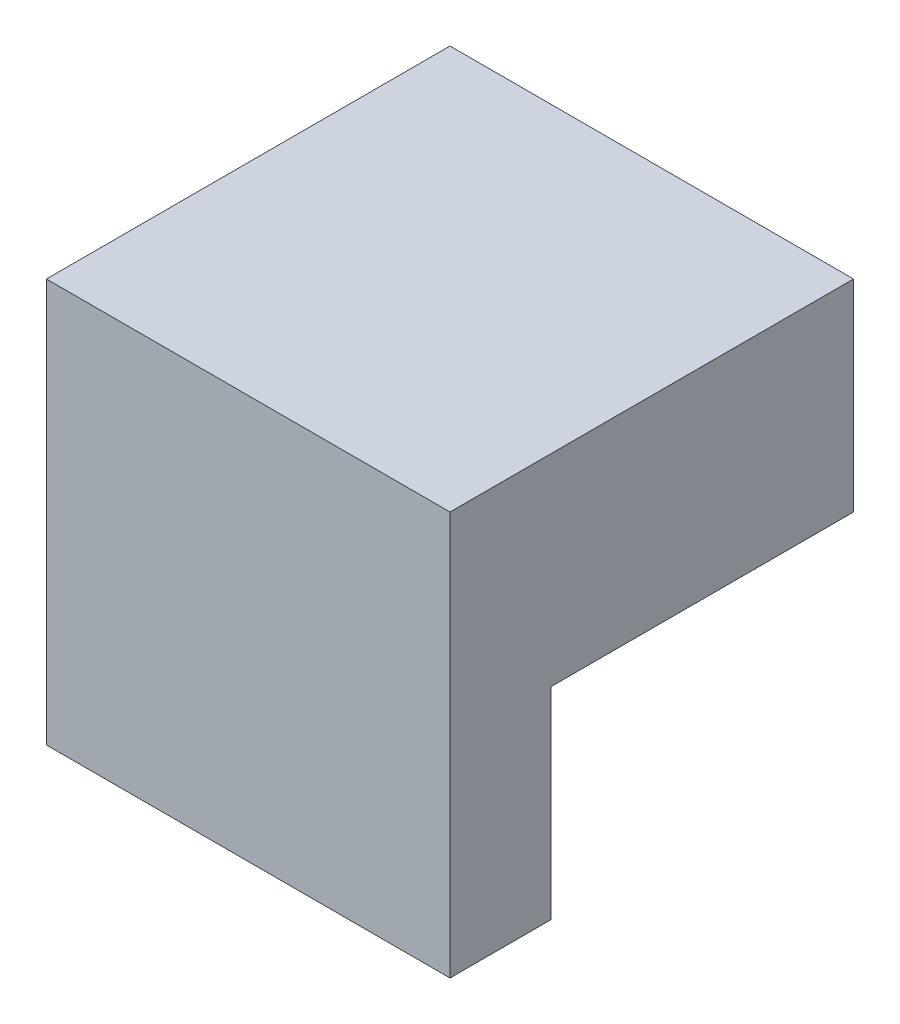
ISO-10303-21;
HEADER;
FILE_DESCRIPTION(('STEP AP214'),'2;1');
FILE_NAME('part.step','',(''),(''),'','','');
FILE_SCHEMA(('AUTOMOTIVE_DESIGN { 1 0 10303 214 1 1 1 1 }'));
ENDSEC;
DATA;
#1=APPLICATION_CONTEXT('core data for automotive mechanical design processes');
#2=APPLICATION_PROTOCOL_DEFINITION('international standard','automotive_design',2000,#1);
#3=PRODUCT_CONTEXT('',#1,'mechanical');
#4=PRODUCT('Part','Part','',(#3));
#5=PRODUCT_RELATED_PRODUCT_CATEGORY('part','',(#4));
#6=PRODUCT_DEFINITION_FORMATION('','',#4);
#7=PRODUCT_DEFINITION_CONTEXT('part definition',#1,'design');
#8=PRODUCT_DEFINITION('design','',#6,#7);
#9=PRODUCT_DEFINITION_SHAPE('','',#8);
#10=(LENGTH_UNIT() NAMED_UNIT(*) SI_UNIT(.MILLI.,.METRE.));
#11=(NAMED_UNIT(*) PLANE_ANGLE_UNIT() SI_UNIT($,.RADIAN.));
#12=(NAMED_UNIT(*) SI_UNIT($,.STERADIAN.) SOLID_ANGLE_UNIT());
#13=UNCERTAINTY_MEASURE_WITH_UNIT(LENGTH_MEASURE(1.E-05),#10,'distance_accuracy_value','');
#14=(GEOMETRIC_REPRESENTATION_CONTEXT(3) GLOBAL_UNCERTAINTY_ASSIGNED_CONTEXT((#13)) GLOBAL_UNIT_ASSIGNED_CONTEXT((#10,
#11,#12)) REPRESENTATION_CONTEXT('',''));
#15=CARTESIAN_POINT('',(0.,0.,0.));
#16=DIRECTION('',(0.,0.,1.));
#17=DIRECTION('',(1.,0.,0.));
#18=AXIS2_PLACEMENT_3D('',#15,#16,#17);
#19=CARTESIAN_POINT('',(0.,0.,40.));
#20=DIRECTION('',(1.,0.,0.));
#21=DIRECTION('',(0.,0.,-1.));
#22=AXIS2_PLACEMENT_3D('',#19,#20,#21);
#23=PLANE('',#22);
#24=DIRECTION('',(0.,-1.,0.));
#25=VECTOR('',#24,1.);
#26=CARTESIAN_POINT('',(0.,0.,0.));
#27=LINE('',#26,#25);
#28=CARTESIAN_POINT('',(0.,40.,0.));
#29=VERTEX_POINT('',#28);
#30=CARTESIAN_POINT('',(0.,20.,0.));
#31=VERTEX_POINT('',#30);
#32=EDGE_CURVE('E119',#29,#31,#27,.T.);
#33=ORIENTED_EDGE('',*,*,#32,.T.);
#34=DIRECTION('',(0.,0.,-1.));
#35=VECTOR('',#34,1.);
#36=CARTESIAN_POINT('',(0.,20.,0.));
#37=LINE('',#36,#35);
#38=CARTESIAN_POINT('',(0.,20.,10.));
#39=VERTEX_POINT('',#38);
#40=EDGE_CURVE('E47',#39,#31,#37,.T.);
#41=ORIENTED_EDGE('',*,*,#40,.F.);
#42=DIRECTION('',(0.,1.,0.));
#43=VECTOR('',#42,1.);
#44=CARTESIAN_POINT('',(0.,0.,10.));
#45=LINE('',#44,#43);
#46=CARTESIAN_POINT('',(0.,0.,10.));
#47=VERTEX_POINT('',#46);
#48=EDGE_CURVE('E107',#47,#39,#45,.T.);
#49=ORIENTED_EDGE('',*,*,#48,.F.);
#50=DIRECTION('',(0.,0.,-1.));
#51=VECTOR('',#50,1.);
#52=CARTESIAN_POINT('',(0.,0.,40.));
#53=LINE('',#52,#51);
#54=CARTESIAN_POINT('',(0.,0.,40.));
#55=VERTEX_POINT('',#54);
#56=EDGE_CURVE('E11',#55,#47,#53,.T.);
#57=ORIENTED_EDGE('',*,*,#56,.F.);
#58=DIRECTION('',(0.,-1.,0.));
#59=VECTOR('',#58,1.);
#60=CARTESIAN_POINT('',(0.,0.,40.));
#61=LINE('',#60,#59);
#62=CARTESIAN_POINT('',(0.,40.,40.));
#63=VERTEX_POINT('',#62);
#64=EDGE_CURVE('E120',#63,#55,#61,.T.);
#65=ORIENTED_EDGE('',*,*,#64,.F.);
#66=DIRECTION('',(0.,0.,-1.));
#67=VECTOR('',#66,1.);
#68=CARTESIAN_POINT('',(0.,40.,40.));
#69=LINE('',#68,#67);
#70=EDGE_CURVE('E126',#63,#29,#69,.T.);
#71=ORIENTED_EDGE('',*,*,#70,.T.);
#72=EDGE_LOOP('',(#33,#41,#49,#57,#65,#71));
#73=FACE_BOUND('',#72,.T.);
#74=ADVANCED_FACE('F33',(#73),#23,.F.);
#75=CARTESIAN_POINT('',(0.,0.,40.));
#76=DIRECTION('',(0.,1.,0.));
#77=DIRECTION('',(0.,0.,1.));
#78=AXIS2_PLACEMENT_3D('',#75,#76,#77);
#79=PLANE('',#78);
#80=ORIENTED_EDGE('',*,*,#56,.T.);
#81=DIRECTION('',(-0.894427190999916,0.,-0.447213595499958));
#82=VECTOR('',#81,1.);
#83=CARTESIAN_POINT('',(0.,0.,10.));
#84=LINE('',#83,#82);
#85=CARTESIAN_POINT('',(40.,0.,30.));
#86=VERTEX_POINT('',#85);
#87=EDGE_CURVE('E108',#86,#47,#84,.T.);
#88=ORIENTED_EDGE('',*,*,#87,.F.);
#89=DIRECTION('',(0.,0.,-1.));
#90=VECTOR('',#89,1.);
#91=CARTESIAN_POINT('',(40.,0.,40.));
#92=LINE('',#91,#90);
#93=CARTESIAN_POINT('',(40.,0.,40.));
#94=VERTEX_POINT('',#93);
#95=EDGE_CURVE('E40',#94,#86,#92,.T.);
#96=ORIENTED_EDGE('',*,*,#95,.F.);
#97=DIRECTION('',(1.,0.,0.));
#98=VECTOR('',#97,1.);
#99=CARTESIAN_POINT('',(0.,0.,40.));
#100=LINE('',#99,#98);
#101=EDGE_CURVE('E78',#55,#94,#100,.T.);
#102=ORIENTED_EDGE('',*,*,#101,.F.);
#103=EDGE_LOOP('',(#80,#88,#96,#102));
#104=FACE_BOUND('',#103,.T.);
#105=ADVANCED_FACE('F143',(#104),#79,.F.);
#106=CARTESIAN_POINT('',(40.,0.,40.));
#107=DIRECTION('',(-1.,0.,0.));
#108=DIRECTION('',(0.,0.,1.));
#109=AXIS2_PLACEMENT_3D('',#106,#107,#108);
#110=PLANE('',#109);
#111=ORIENTED_EDGE('',*,*,#95,.T.);
#112=DIRECTION('',(0.,-1.,0.));
#113=VECTOR('',#112,1.);
#114=CARTESIAN_POINT('',(40.,20.,30.));
#115=LINE('',#114,#113);
#116=CARTESIAN_POINT('',(40.,20.,30.));
#117=VERTEX_POINT('',#116);
#118=EDGE_CURVE('E104',#117,#86,#115,.T.);
#119=ORIENTED_EDGE('',*,*,#118,.F.);
#120=DIRECTION('',(0.,0.,-1.));
#121=VECTOR('',#120,1.);
#122=CARTESIAN_POINT('',(40.,20.,0.));
#123=LINE('',#122,#121);
#124=CARTESIAN_POINT('',(40.,20.,0.));
#125=VERTEX_POINT('',#124);
#126=EDGE_CURVE('E92',#117,#125,#123,.T.);
#127=ORIENTED_EDGE('',*,*,#126,.T.);
#128=DIRECTION('',(0.,1.,0.));
#129=VECTOR('',#128,1.);
#130=CARTESIAN_POINT('',(40.,0.,0.));
#131=LINE('',#130,#129);
#132=CARTESIAN_POINT('',(40.,40.,0.));
#133=VERTEX_POINT('',#132);
#134=EDGE_CURVE('E129',#125,#133,#131,.T.);
#135=ORIENTED_EDGE('',*,*,#134,.T.);
#136=DIRECTION('',(0.,0.,-1.));
#137=VECTOR('',#136,1.);
#138=CARTESIAN_POINT('',(40.,40.,40.));
#139=LINE('',#138,#137);
#140=CARTESIAN_POINT('',(40.,40.,40.));
#141=VERTEX_POINT('',#140);
#142=EDGE_CURVE('E133',#141,#133,#139,.T.);
#143=ORIENTED_EDGE('',*,*,#142,.F.);
#144=DIRECTION('',(0.,1.,0.));
#145=VECTOR('',#144,1.);
#146=CARTESIAN_POINT('',(40.,0.,40.));
#147=LINE('',#146,#145);
#148=EDGE_CURVE('E123',#94,#141,#147,.T.);
#149=ORIENTED_EDGE('',*,*,#148,.F.);
#150=EDGE_LOOP('',(#111,#119,#127,#135,#143,#149));
#151=FACE_BOUND('',#150,.T.);
#152=ADVANCED_FACE('F111',(#151),#110,.F.);
#153=CARTESIAN_POINT('',(0.,40.,40.));
#154=DIRECTION('',(0.,-1.,0.));
#155=DIRECTION('',(0.,0.,-1.));
#156=AXIS2_PLACEMENT_3D('',#153,#154,#155);
#157=PLANE('',#156);
#158=DIRECTION('',(-1.,0.,0.));
#159=VECTOR('',#158,1.);
#160=CARTESIAN_POINT('',(0.,40.,0.));
#161=LINE('',#160,#159);
#162=EDGE_CURVE('E71',#133,#29,#161,.T.);
#163=ORIENTED_EDGE('',*,*,#162,.T.);
#164=ORIENTED_EDGE('',*,*,#70,.F.);
#165=DIRECTION('',(-1.,0.,0.));
#166=VECTOR('',#165,1.);
#167=CARTESIAN_POINT('',(0.,40.,40.));
#168=LINE('',#167,#166);
#169=EDGE_CURVE('E56',#141,#63,#168,.T.);
#170=ORIENTED_EDGE('',*,*,#169,.F.);
#171=ORIENTED_EDGE('',*,*,#142,.T.);
#172=EDGE_LOOP('',(#163,#164,#170,#171));
#173=FACE_BOUND('',#172,.T.);
#174=ADVANCED_FACE('F135',(#173),#157,.F.);
#175=CARTESIAN_POINT('',(0.,0.,40.));
#176=DIRECTION('',(0.,0.,-1.));
#177=DIRECTION('',(-1.,0.,0.));
#178=AXIS2_PLACEMENT_3D('',#175,#176,#177);
#179=PLANE('',#178);
#180=ORIENTED_EDGE('',*,*,#64,.T.);
#181=ORIENTED_EDGE('',*,*,#101,.T.);
#182=ORIENTED_EDGE('',*,*,#148,.T.);
#183=ORIENTED_EDGE('',*,*,#169,.T.);
#184=EDGE_LOOP('',(#180,#181,#182,#183));
#185=FACE_BOUND('',#184,.T.);
#186=ADVANCED_FACE('F142',(#185),#179,.F.);
#187=CARTESIAN_POINT('',(0.,0.,0.));
#188=DIRECTION('',(0.,0.,-1.));
#189=DIRECTION('',(-1.,0.,0.));
#190=AXIS2_PLACEMENT_3D('',#187,#188,#189);
#191=PLANE('',#190);
#192=DIRECTION('',(-1.,0.,0.));
#193=VECTOR('',#192,1.);
#194=CARTESIAN_POINT('',(40.,20.,0.));
#195=LINE('',#194,#193);
#196=EDGE_CURVE('E97',#125,#31,#195,.T.);
#197=ORIENTED_EDGE('',*,*,#196,.T.);
#198=ORIENTED_EDGE('',*,*,#32,.F.);
#199=ORIENTED_EDGE('',*,*,#162,.F.);
#200=ORIENTED_EDGE('',*,*,#134,.F.);
#201=EDGE_LOOP('',(#197,#198,#199,#200));
#202=FACE_BOUND('',#201,.T.);
#203=ADVANCED_FACE('F138',(#202),#191,.T.);
#204=CARTESIAN_POINT('',(40.,20.,0.));
#205=DIRECTION('',(0.,1.,0.));
#206=DIRECTION('',(0.,0.,1.));
#207=AXIS2_PLACEMENT_3D('',#204,#205,#206);
#208=PLANE('',#207);
#209=ORIENTED_EDGE('',*,*,#40,.T.);
#210=ORIENTED_EDGE('',*,*,#196,.F.);
#211=ORIENTED_EDGE('',*,*,#126,.F.);
#212=DIRECTION('',(-0.894427190999916,0.,-0.447213595499958));
#213=VECTOR('',#212,1.);
#214=CARTESIAN_POINT('',(0.,20.,10.));
#215=LINE('',#214,#213);
#216=EDGE_CURVE('E95',#117,#39,#215,.T.);
#217=ORIENTED_EDGE('',*,*,#216,.T.);
#218=EDGE_LOOP('',(#209,#210,#211,#217));
#219=FACE_BOUND('',#218,.T.);
#220=ADVANCED_FACE('F94',(#219),#208,.F.);
#221=CARTESIAN_POINT('',(0.,20.,10.));
#222=DIRECTION('',(-0.447213595499958,0.,0.894427190999916));
#223=DIRECTION('',(0.894427190999916,0.,0.447213595499958));
#224=AXIS2_PLACEMENT_3D('',#221,#222,#223);
#225=PLANE('',#224);
#226=ORIENTED_EDGE('',*,*,#87,.T.);
#227=ORIENTED_EDGE('',*,*,#48,.T.);
#228=ORIENTED_EDGE('',*,*,#216,.F.);
#229=ORIENTED_EDGE('',*,*,#118,.T.);
#230=EDGE_LOOP('',(#226,#227,#228,#229));
#231=FACE_BOUND('',#230,.T.);
#232=ADVANCED_FACE('F103',(#231),#225,.F.);
#233=CLOSED_SHELL('',(#74,#105,#152,#174,#186,#203,#220,#232));
#234=MANIFOLD_SOLID_BREP('B2',#233);
#235=ADVANCED_BREP_SHAPE_REPRESENTATION('',(#18,#234),#14);
#236=SHAPE_DEFINITION_REPRESENTATION(#9,#235);
ENDSEC;
END-ISO-10303-21;
